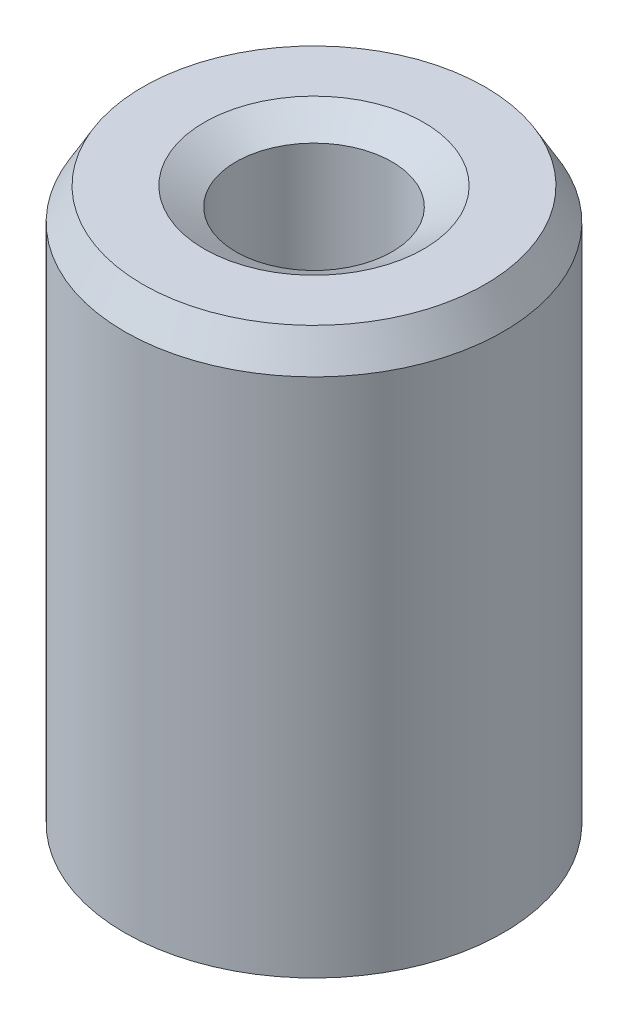
ISO-10303-21;
HEADER;
FILE_DESCRIPTION(('STEP AP214'),'2;1');
FILE_NAME('part.step','',(''),(''),'','','');
FILE_SCHEMA(('AUTOMOTIVE_DESIGN { 1 0 10303 214 1 1 1 1 }'));
ENDSEC;
DATA;
#1=APPLICATION_CONTEXT('core data for automotive mechanical design processes');
#2=APPLICATION_PROTOCOL_DEFINITION('international standard','automotive_design',2000,#1);
#3=PRODUCT_CONTEXT('',#1,'mechanical');
#4=PRODUCT('Part','Part','',(#3));
#5=PRODUCT_RELATED_PRODUCT_CATEGORY('part','',(#4));
#6=PRODUCT_DEFINITION_FORMATION('','',#4);
#7=PRODUCT_DEFINITION_CONTEXT('part definition',#1,'design');
#8=PRODUCT_DEFINITION('design','',#6,#7);
#9=PRODUCT_DEFINITION_SHAPE('','',#8);
#10=(LENGTH_UNIT() NAMED_UNIT(*) SI_UNIT(.MILLI.,.METRE.));
#11=(NAMED_UNIT(*) PLANE_ANGLE_UNIT() SI_UNIT($,.RADIAN.));
#12=(NAMED_UNIT(*) SI_UNIT($,.STERADIAN.) SOLID_ANGLE_UNIT());
#13=UNCERTAINTY_MEASURE_WITH_UNIT(LENGTH_MEASURE(1.E-05),#10,'distance_accuracy_value','');
#14=(GEOMETRIC_REPRESENTATION_CONTEXT(3) GLOBAL_UNCERTAINTY_ASSIGNED_CONTEXT((#13)) GLOBAL_UNIT_ASSIGNED_CONTEXT((#10,
#11,#12)) REPRESENTATION_CONTEXT('',''));
#15=CARTESIAN_POINT('',(0.,0.,0.));
#16=DIRECTION('',(0.,0.,1.));
#17=DIRECTION('',(1.,0.,0.));
#18=AXIS2_PLACEMENT_3D('',#15,#16,#17);
#19=CARTESIAN_POINT('',(0.,60.2459556123759,0.));
#20=DIRECTION('',(0.,-1.,0.));
#21=DIRECTION('',(0.,0.,-1.));
#22=AXIS2_PLACEMENT_3D('',#19,#20,#21);
#23=CYLINDRICAL_SURFACE('',#22,20.);
#24=CARTESIAN_POINT('',(0.,1.93220282427409,0.));
#25=DIRECTION('',(0.,1.,0.));
#26=DIRECTION('',(0.,0.,1.));
#27=AXIS2_PLACEMENT_3D('',#24,#25,#26);
#28=CIRCLE('',#27,20.);
#29=CARTESIAN_POINT('',(0.,1.93220282427409,20.));
#30=VERTEX_POINT('',#29);
#31=EDGE_CURVE('E10',#30,#30,#28,.T.);
#32=ORIENTED_EDGE('',*,*,#31,.T.);
#33=EDGE_LOOP('',(#32));
#34=FACE_BOUND('',#33,.T.);
#35=CARTESIAN_POINT('',(0.,56.8992821502051,0.));
#36=DIRECTION('',(0.,1.,0.));
#37=DIRECTION('',(0.,0.,1.));
#38=AXIS2_PLACEMENT_3D('',#35,#36,#37);
#39=CIRCLE('',#38,20.);
#40=CARTESIAN_POINT('',(0.,56.8992821502051,20.));
#41=VERTEX_POINT('',#40);
#42=EDGE_CURVE('E50',#41,#41,#39,.F.);
#43=ORIENTED_EDGE('',*,*,#42,.T.);
#44=EDGE_LOOP('',(#43));
#45=FACE_BOUND('',#44,.T.);
#46=ADVANCED_FACE('F39',(#34,#45),#23,.T.);
#47=CARTESIAN_POINT('',(0.,60.2459556123759,0.));
#48=DIRECTION('',(0.,1.,0.));
#49=DIRECTION('',(0.,0.,1.));
#50=AXIS2_PLACEMENT_3D('',#47,#48,#49);
#51=PLANE('',#50);
#52=CARTESIAN_POINT('',(0.,60.2459556123759,0.));
#53=DIRECTION('',(0.,1.,0.));
#54=DIRECTION('',(0.,0.,1.));
#55=AXIS2_PLACEMENT_3D('',#52,#53,#54);
#56=CIRCLE('',#55,11.5865157234501);
#57=CARTESIAN_POINT('',(0.,60.2459556123759,11.5865157234501));
#58=VERTEX_POINT('',#57);
#59=EDGE_CURVE('E58',#58,#58,#56,.F.);
#60=ORIENTED_EDGE('',*,*,#59,.T.);
#61=EDGE_LOOP('',(#60));
#62=FACE_BOUND('',#61,.T.);
#63=CARTESIAN_POINT('',(0.,60.2459556123759,0.));
#64=DIRECTION('',(0.,1.,0.));
#65=DIRECTION('',(0.,0.,1.));
#66=AXIS2_PLACEMENT_3D('',#63,#64,#65);
#67=CIRCLE('',#66,18.0677971757259);
#68=CARTESIAN_POINT('',(0.,60.2459556123759,18.0677971757259));
#69=VERTEX_POINT('',#68);
#70=EDGE_CURVE('E61',#69,#69,#67,.T.);
#71=ORIENTED_EDGE('',*,*,#70,.T.);
#72=EDGE_LOOP('',(#71));
#73=FACE_BOUND('',#72,.T.);
#74=ADVANCED_FACE('F88',(#62,#73),#51,.T.);
#75=CARTESIAN_POINT('',(0.,0.,0.));
#76=DIRECTION('',(0.,1.,0.));
#77=DIRECTION('',(0.,0.,1.));
#78=AXIS2_PLACEMENT_3D('',#75,#76,#77);
#79=PLANE('',#78);
#80=CARTESIAN_POINT('',(0.,0.,0.));
#81=DIRECTION('',(0.,1.,0.));
#82=DIRECTION('',(0.,0.,1.));
#83=AXIS2_PLACEMENT_3D('',#80,#81,#82);
#84=CIRCLE('',#83,10.1720450855533);
#85=CARTESIAN_POINT('',(0.,0.,10.1720450855533));
#86=VERTEX_POINT('',#85);
#87=EDGE_CURVE('E51',#86,#86,#84,.T.);
#88=ORIENTED_EDGE('',*,*,#87,.T.);
#89=EDGE_LOOP('',(#88));
#90=FACE_BOUND('',#89,.T.);
#91=CARTESIAN_POINT('',(0.,0.,0.));
#92=DIRECTION('',(0.,1.,0.));
#93=DIRECTION('',(0.,0.,1.));
#94=AXIS2_PLACEMENT_3D('',#91,#92,#93);
#95=CIRCLE('',#94,16.6533265378292);
#96=CARTESIAN_POINT('',(0.,0.,16.6533265378292));
#97=VERTEX_POINT('',#96);
#98=EDGE_CURVE('E54',#97,#97,#95,.F.);
#99=ORIENTED_EDGE('',*,*,#98,.T.);
#100=EDGE_LOOP('',(#99));
#101=FACE_BOUND('',#100,.T.);
#102=ADVANCED_FACE('F83',(#90,#101),#79,.F.);
#103=CARTESIAN_POINT('',(0.,60.2459556123759,0.));
#104=DIRECTION('',(0.,-1.,0.));
#105=DIRECTION('',(0.,0.,-1.));
#106=AXIS2_PLACEMENT_3D('',#103,#104,#105);
#107=CYLINDRICAL_SURFACE('',#106,8.23984226127921);
#108=CARTESIAN_POINT('',(0.,58.3137527881019,0.));
#109=DIRECTION('',(0.,1.,0.));
#110=DIRECTION('',(0.,0.,1.));
#111=AXIS2_PLACEMENT_3D('',#108,#109,#110);
#112=CIRCLE('',#111,8.23984226127921);
#113=CARTESIAN_POINT('',(0.,58.3137527881019,8.23984226127921));
#114=VERTEX_POINT('',#113);
#115=EDGE_CURVE('E67',#114,#114,#112,.T.);
#116=ORIENTED_EDGE('',*,*,#115,.T.);
#117=EDGE_LOOP('',(#116));
#118=FACE_BOUND('',#117,.T.);
#119=CARTESIAN_POINT('',(0.,3.34667346217084,0.));
#120=DIRECTION('',(0.,1.,0.));
#121=DIRECTION('',(0.,0.,1.));
#122=AXIS2_PLACEMENT_3D('',#119,#120,#121);
#123=CIRCLE('',#122,8.23984226127921);
#124=CARTESIAN_POINT('',(0.,3.34667346217084,8.23984226127921));
#125=VERTEX_POINT('',#124);
#126=EDGE_CURVE('E69',#125,#125,#123,.F.);
#127=ORIENTED_EDGE('',*,*,#126,.T.);
#128=EDGE_LOOP('',(#127));
#129=FACE_BOUND('',#128,.T.);
#130=ADVANCED_FACE('F71',(#118,#129),#107,.F.);
#131=CARTESIAN_POINT('',(0.,58.3137527881019,0.));
#132=DIRECTION('',(0.,1.,0.));
#133=DIRECTION('',(0.,0.,1.));
#134=AXIS2_PLACEMENT_3D('',#131,#132,#133);
#135=CONICAL_SURFACE('',#134,8.23984226127921,1.0471975511966);
#136=ORIENTED_EDGE('',*,*,#59,.F.);
#137=EDGE_LOOP('',(#136));
#138=FACE_BOUND('',#137,.T.);
#139=ORIENTED_EDGE('',*,*,#115,.F.);
#140=EDGE_LOOP('',(#139));
#141=FACE_BOUND('',#140,.T.);
#142=ADVANCED_FACE('F77',(#138,#141),#135,.F.);
#143=CARTESIAN_POINT('',(0.,0.,0.));
#144=DIRECTION('',(0.,-1.,0.));
#145=DIRECTION('',(0.,0.,-1.));
#146=AXIS2_PLACEMENT_3D('',#143,#144,#145);
#147=CONICAL_SURFACE('',#146,10.1720450855533,0.523598775598295);
#148=ORIENTED_EDGE('',*,*,#126,.F.);
#149=EDGE_LOOP('',(#148));
#150=FACE_BOUND('',#149,.T.);
#151=ORIENTED_EDGE('',*,*,#87,.F.);
#152=EDGE_LOOP('',(#151));
#153=FACE_BOUND('',#152,.T.);
#154=ADVANCED_FACE('F73',(#150,#153),#147,.F.);
#155=CARTESIAN_POINT('',(0.,1.93220282427409,0.));
#156=DIRECTION('',(0.,1.,0.));
#157=DIRECTION('',(0.,0.,1.));
#158=AXIS2_PLACEMENT_3D('',#155,#156,#157);
#159=CONICAL_SURFACE('',#158,20.,1.0471975511966);
#160=ORIENTED_EDGE('',*,*,#98,.F.);
#161=EDGE_LOOP('',(#160));
#162=FACE_BOUND('',#161,.T.);
#163=ORIENTED_EDGE('',*,*,#31,.F.);
#164=EDGE_LOOP('',(#163));
#165=FACE_BOUND('',#164,.T.);
#166=ADVANCED_FACE('F76',(#162,#165),#159,.T.);
#167=CARTESIAN_POINT('',(0.,60.2459556123759,0.));
#168=DIRECTION('',(0.,-1.,0.));
#169=DIRECTION('',(0.,0.,-1.));
#170=AXIS2_PLACEMENT_3D('',#167,#168,#169);
#171=CONICAL_SURFACE('',#170,18.0677971757259,0.523598775598296);
#172=ORIENTED_EDGE('',*,*,#42,.F.);
#173=EDGE_LOOP('',(#172));
#174=FACE_BOUND('',#173,.T.);
#175=ORIENTED_EDGE('',*,*,#70,.F.);
#176=EDGE_LOOP('',(#175));
#177=FACE_BOUND('',#176,.T.);
#178=ADVANCED_FACE('F45',(#174,#177),#171,.T.);
#179=CLOSED_SHELL('',(#46,#74,#102,#130,#142,#154,#166,#178));
#180=MANIFOLD_SOLID_BREP('B2',#179);
#181=ADVANCED_BREP_SHAPE_REPRESENTATION('',(#18,#180),#14);
#182=SHAPE_DEFINITION_REPRESENTATION(#9,#181);
ENDSEC;
END-ISO-10303-21;
